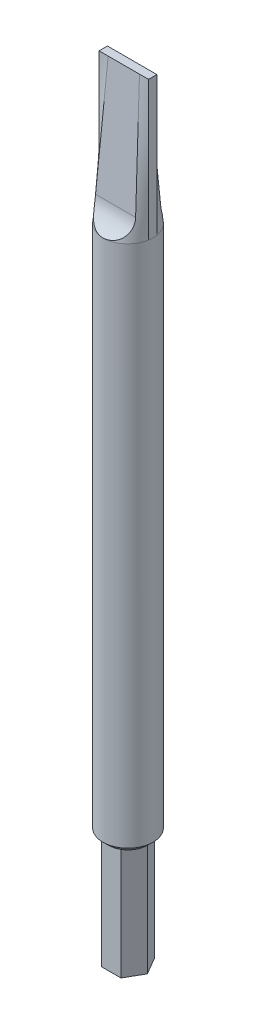
ISO-10303-21;
HEADER;
FILE_DESCRIPTION(('STEP AP214'),'2;1');
FILE_NAME('part.step','',(''),(''),'','','');
FILE_SCHEMA(('AUTOMOTIVE_DESIGN { 1 0 10303 214 1 1 1 1 }'));
ENDSEC;
DATA;
#1=APPLICATION_CONTEXT('core data for automotive mechanical design processes');
#2=APPLICATION_PROTOCOL_DEFINITION('international standard','automotive_design',2000,#1);
#3=PRODUCT_CONTEXT('',#1,'mechanical');
#4=PRODUCT('Part','Part','',(#3));
#5=PRODUCT_RELATED_PRODUCT_CATEGORY('part','',(#4));
#6=PRODUCT_DEFINITION_FORMATION('','',#4);
#7=PRODUCT_DEFINITION_CONTEXT('part definition',#1,'design');
#8=PRODUCT_DEFINITION('design','',#6,#7);
#9=PRODUCT_DEFINITION_SHAPE('','',#8);
#10=(LENGTH_UNIT() NAMED_UNIT(*) SI_UNIT(.MILLI.,.METRE.));
#11=(NAMED_UNIT(*) PLANE_ANGLE_UNIT() SI_UNIT($,.RADIAN.));
#12=(NAMED_UNIT(*) SI_UNIT($,.STERADIAN.) SOLID_ANGLE_UNIT());
#13=UNCERTAINTY_MEASURE_WITH_UNIT(LENGTH_MEASURE(1.E-05),#10,'distance_accuracy_value','');
#14=(GEOMETRIC_REPRESENTATION_CONTEXT(3) GLOBAL_UNCERTAINTY_ASSIGNED_CONTEXT((#13)) GLOBAL_UNIT_ASSIGNED_CONTEXT((#10,
#11,#12)) REPRESENTATION_CONTEXT('',''));
#15=CARTESIAN_POINT('',(0.,0.,0.));
#16=DIRECTION('',(0.,0.,1.));
#17=DIRECTION('',(1.,0.,0.));
#18=AXIS2_PLACEMENT_3D('',#15,#16,#17);
#19=CARTESIAN_POINT('',(4.43705983732471,95.,-0.750000000000001));
#20=CARTESIAN_POINT('',(4.43705983732471,120.,-0.75));
#21=CARTESIAN_POINT('',(4.37543400625076,95.,-1.11458333333333));
#22=CARTESIAN_POINT('',(4.06730485088098,120.,-0.75));
#23=CARTESIAN_POINT('',(4.26263040885428,95.,-1.51144062639458));
#24=CARTESIAN_POINT('',(3.69754986443725,120.,-0.75));
#25=CARTESIAN_POINT('',(3.87668954751207,95.,-2.32932370481561));
#26=CARTESIAN_POINT('',(2.9580398915498,120.,-0.75));
#27=CARTESIAN_POINT('',(3.60180063929756,95.,-2.75068870523416));
#28=CARTESIAN_POINT('',(2.58828490510607,120.,-0.75));
#29=CARTESIAN_POINT('',(2.85210457862929,95.,-3.52203856749311));
#30=CARTESIAN_POINT('',(1.84877493221862,120.,-0.75));
#31=CARTESIAN_POINT('',(2.37524833719888,95.,-3.86993206223975));
#32=CARTESIAN_POINT('',(1.47901994577489,120.,-0.75));
#33=CARTESIAN_POINT('',(1.54287419283115,95.,-4.23811089195704));
#34=CARTESIAN_POINT('',(0.9243874661093,120.,-0.75));
#35=CARTESIAN_POINT('',(1.24681967389097,95.,-4.33516804818502));
#36=CARTESIAN_POINT('',(0.739509972887437,120.,-0.75));
#37=CARTESIAN_POINT('',(0.633788469081093,95.,-4.46615645512624));
#38=CARTESIAN_POINT('',(0.369754986443711,120.,-0.75));
#39=CARTESIAN_POINT('',(0.316932845523195,95.,-4.5));
#40=CARTESIAN_POINT('',(0.184877493221848,120.,-0.75));
#41=CARTESIAN_POINT('',(-0.316932845523193,95.,-4.5));
#42=CARTESIAN_POINT('',(-0.184877493221878,120.,-0.75));
#43=CARTESIAN_POINT('',(-0.633788469081092,95.,-4.46615645512624));
#44=CARTESIAN_POINT('',(-0.369754986443741,120.,-0.75));
#45=CARTESIAN_POINT('',(-1.24681967389097,95.,-4.33516804818502));
#46=CARTESIAN_POINT('',(-0.739509972887467,120.,-0.75));
#47=CARTESIAN_POINT('',(-1.54287419283115,95.,-4.23811089195704));
#48=CARTESIAN_POINT('',(-0.92438746610933,120.,-0.75));
#49=CARTESIAN_POINT('',(-2.37524833719888,95.,-3.86993206223976));
#50=CARTESIAN_POINT('',(-1.47901994577492,120.,-0.75));
#51=CARTESIAN_POINT('',(-2.85210457862929,95.,-3.52203856749311));
#52=CARTESIAN_POINT('',(-1.84877493221864,120.,-0.75));
#53=CARTESIAN_POINT('',(-3.60180063929756,95.,-2.75068870523416));
#54=CARTESIAN_POINT('',(-2.58828490510609,120.,-0.75));
#55=CARTESIAN_POINT('',(-3.87668954751207,95.,-2.32932370481561));
#56=CARTESIAN_POINT('',(-2.95803989154982,120.,-0.75));
#57=CARTESIAN_POINT('',(-4.26263040885428,95.,-1.51144062639458));
#58=CARTESIAN_POINT('',(-3.69754986443726,120.,-0.75));
#59=CARTESIAN_POINT('',(-4.37543400625076,95.,-1.11458333333333));
#60=CARTESIAN_POINT('',(-4.06730485088099,120.,-0.75));
#61=CARTESIAN_POINT('',(-4.43705983732471,95.,-0.750000000000003));
#62=CARTESIAN_POINT('',(-4.43705983732471,120.,-0.75));
#63=B_SPLINE_SURFACE_WITH_KNOTS('',3,1,((#19,#20),(#21,#22),(#23,#24),(#25,#26),(#27,#28),(#29,
#30),(#31,#32),(#33,#34),(#35,#36),(#37,#38),(#39,#40),(#41,#42),(#43,#44),(#45,#46),(#47,#48),
(#49,#50),(#51,#52),(#53,#54),(#55,#56),(#57,#58),(#59,#60),(#61,#62)),.UNSPECIFIED.,.F.,.F.,
.F.,(4,2,2,2,2,2,2,2,2,2,4),(2,2),(0.,0.125,0.25,0.375,0.4375,0.5,0.5625,0.625,0.75,0.875,1.),
(0.,1.),.UNSPECIFIED.);
#64=DIRECTION('',(-1.,0.,0.));
#65=VECTOR('',#64,1.);
#66=CARTESIAN_POINT('',(-4.43705983732471,120.,-0.75));
#67=LINE('',#66,#65);
#68=CARTESIAN_POINT('',(-2.80829555421604,120.,-0.75));
#69=VERTEX_POINT('',#68);
#70=CARTESIAN_POINT('',(-4.43705983732471,120.,-0.75));
#71=VERTEX_POINT('',#70);
#72=EDGE_CURVE('E349',#69,#71,#67,.T.);
#73=CARTESIAN_POINT('',(-3.59892322467151,98.8486745427176,-2.22904475760722));
#74=CARTESIAN_POINT('',(-3.49083341758224,101.740355129243,-2.02683875303279));
#75=CARTESIAN_POINT('',(-3.38274361066169,104.632035715774,-1.82463274845763));
#76=CARTESIAN_POINT('',(-3.11958199560018,111.672286366834,-1.33233046514558));
#77=CARTESIAN_POINT('',(-2.96451018748197,115.820856431362,-1.0422341864086));
#78=CARTESIAN_POINT('',(-2.80905743738754,119.979617663917,-0.751425271782207));
#79=CARTESIAN_POINT('',(-2.80867649580179,119.989808831959,-0.750712635891102));
#80=CARTESIAN_POINT('',(-2.80829555421603,120.,-0.749999999999998));
#81=B_SPLINE_CURVE_WITH_KNOTS('',3,(#73,#74,#75,#76,#77,#78,#79,#80),.UNSPECIFIED.,.F.,.F.,(4,2,
2,4),(0.,8.70226899162103,21.187040926751,21.2177103879796),.UNSPECIFIED.);
#82=CARTESIAN_POINT('',(-3.59892322467151,98.8486745427176,-2.22904475760722));
#83=VERTEX_POINT('',#82);
#84=EDGE_CURVE('E12',#69,#83,#81,.F.);
#85=CARTESIAN_POINT('',(-3.59892322467151,98.8486745427176,-2.22904475760722));
#86=CARTESIAN_POINT('',(-3.60293934350547,98.7405535675186,-2.23658640081067));
#87=CARTESIAN_POINT('',(-3.60406231887814,98.6325831890698,-2.24768729077878));
#88=CARTESIAN_POINT('',(-3.60062632458166,98.4176827890551,-2.2768589978853));
#89=CARTESIAN_POINT('',(-3.59606759944172,98.3107527229157,-2.29492951504155));
#90=CARTESIAN_POINT('',(-3.58135789830064,98.0984465368183,-2.33793636851637));
#91=CARTESIAN_POINT('',(-3.57119554309247,97.9930740283356,-2.36288662370164));
#92=CARTESIAN_POINT('',(-3.54519646245648,97.7848163720109,-2.4193570626618));
#93=CARTESIAN_POINT('',(-3.52935968267629,97.6819312480043,-2.450877309366));
#94=CARTESIAN_POINT('',(-3.49180300241229,97.4792915669902,-2.52012358463183));
#95=CARTESIAN_POINT('',(-3.47007920891334,97.3795391304768,-2.55785371321155));
#96=CARTESIAN_POINT('',(-3.42044540209063,97.1839561915233,-2.63898114056189));
#97=CARTESIAN_POINT('',(-3.39253576053734,97.0881254537983,-2.68237809869079));
#98=CARTESIAN_POINT('',(-3.33016429650252,96.9011908711795,-2.77411901044245));
#99=CARTESIAN_POINT('',(-3.29570870184274,96.8100826373213,-2.82245824195835));
#100=CARTESIAN_POINT('',(-3.21983077575398,96.6332052257892,-2.92326853253749));
#101=CARTESIAN_POINT('',(-3.17840890349768,96.5474356967321,-2.97573931915378));
#102=CARTESIAN_POINT('',(-3.08931934789289,96.3841642770508,-3.08229916826232));
#103=CARTESIAN_POINT('',(-3.04184820942839,96.3065026747279,-3.13630748490522));
#104=CARTESIAN_POINT('',(-2.93961937922463,96.1574699970874,-3.24609114836995));
#105=CARTESIAN_POINT('',(-2.88486173610647,96.0860988798,-3.30186648339899));
#106=CARTESIAN_POINT('',(-2.76802495761936,95.9501240798014,-3.41389420915612));
#107=CARTESIAN_POINT('',(-2.70594985857307,95.8855167029905,-3.47014632114661));
#108=CARTESIAN_POINT('',(-2.57454566103661,95.7633312802212,-3.58180913437112));
#109=CARTESIAN_POINT('',(-2.50521703419322,95.7057527777505,-3.63721989004478));
#110=CARTESIAN_POINT('',(-2.36662240784246,95.6030042398465,-3.74055976544491));
#111=CARTESIAN_POINT('',(-2.29799849056612,95.557172729832,-3.78869425488719));
#112=CARTESIAN_POINT('',(-2.15537476586022,95.471379184874,-3.88214346444769));
#113=CARTESIAN_POINT('',(-2.08137537790893,95.4314166926718,-3.92745840408));
#114=CARTESIAN_POINT('',(-1.92841152270123,95.357303112015,-4.01429097934524));
#115=CARTESIAN_POINT('',(-1.84944733273736,95.323151699396,-4.0558088267348));
#116=CARTESIAN_POINT('',(-1.68712402480413,95.2604593766965,-4.13424043274664));
#117=CARTESIAN_POINT('',(-1.60376463169689,95.2319188183831,-4.17115390264882));
#118=CARTESIAN_POINT('',(-1.43712273157251,95.1812847813427,-4.23826656210703));
#119=CARTESIAN_POINT('',(-1.3539999989422,95.1589619284157,-4.26869055781762));
#120=CARTESIAN_POINT('',(-1.18495484263154,95.1189272696643,-4.32432792432823));
#121=CARTESIAN_POINT('',(-1.09903266347683,95.1012150623184,-4.34954174882048));
#122=CARTESIAN_POINT('',(-0.924932598078182,95.070220925598,-4.39433657508877));
#123=CARTESIAN_POINT('',(-0.83675427189721,95.0569398674735,-4.41391646902067));
#124=CARTESIAN_POINT('',(-0.658769285669557,95.0345977989366,-4.44720694087929));
#125=CARTESIAN_POINT('',(-0.56896253145881,95.0255370333769,-4.46091717825693));
#126=CARTESIAN_POINT('',(-0.385509620516646,95.0112402606007,-4.48268042303993));
#127=CARTESIAN_POINT('',(-0.291830977963934,95.006132111535,-4.49054401554672));
#128=CARTESIAN_POINT('',(-0.104018965992552,95.0001626926024,-4.49974306971542));
#129=CARTESIAN_POINT('',(-0.00988560396492934,94.9993013539384,-4.50107863712935));
#130=CARTESIAN_POINT('',(0.178202704669686,95.0018374616447,-4.49716233857819));
#131=CARTESIAN_POINT('',(0.272157616055407,95.005235675759,-4.49190928507649));
#132=CARTESIAN_POINT('',(0.459234027866628,95.0162932431291,-4.47497289692342));
#133=CARTESIAN_POINT('',(0.552355505127167,95.0239527144534,-4.46328938410067));
#134=CARTESIAN_POINT('',(0.738860208092008,95.0438585489124,-4.43335086394105));
#135=CARTESIAN_POINT('',(0.832215497622931,95.056188364351,-4.4149765476268));
#136=CARTESIAN_POINT('',(1.01667354680881,95.0856772756296,-4.37187860727414));
#137=CARTESIAN_POINT('',(1.10777628358515,95.1028364204979,-4.34715491877576));
#138=CARTESIAN_POINT('',(1.28702287178397,95.1421751673892,-4.29182803289247));
#139=CARTESIAN_POINT('',(1.37516791250423,95.16435272303,-4.2612272328137));
#140=CARTESIAN_POINT('',(1.54787494178746,95.2139877446648,-4.19466440902625));
#141=CARTESIAN_POINT('',(1.63243707322781,95.2414449998754,-4.15870259935999));
#142=CARTESIAN_POINT('',(1.79544952662088,95.3012691059148,-4.082858099758));
#143=CARTESIAN_POINT('',(1.87399420702169,95.3335125112558,-4.04308100568776));
#144=CARTESIAN_POINT('',(2.0264035496312,95.4035706246093,-3.95965926032924));
#145=CARTESIAN_POINT('',(2.10026832935262,95.4413851926499,-3.91601470621929));
#146=CARTESIAN_POINT('',(2.24288717637036,95.5226404168432,-3.82578731131685));
#147=CARTESIAN_POINT('',(2.31164298650577,95.5660791404131,-3.7792054826437));
#148=CARTESIAN_POINT('',(2.44377080230154,95.6586287588433,-3.68400468271338));
#149=CARTESIAN_POINT('',(2.50714041796408,95.7077421491339,-3.63538482126733));
#150=CARTESIAN_POINT('',(2.62666032186387,95.8101915496243,-3.53837633497427));
#151=CARTESIAN_POINT('',(2.68295577770646,95.8633840469406,-3.49001474284895));
#152=CARTESIAN_POINT('',(2.79006884725087,95.9748809658664,-3.39319500258708));
#153=CARTESIAN_POINT('',(2.84088876018525,96.0331832230422,-3.3447369037491));
#154=CARTESIAN_POINT('',(2.93707502413029,96.1546937141666,-3.24854076104307));
#155=CARTESIAN_POINT('',(2.98244042576204,96.217902799026,-3.2008028437863));
#156=CARTESIAN_POINT('',(3.06777803030964,96.3489164800583,-3.10683869375862));
#157=CARTESIAN_POINT('',(3.10775003951796,96.4167212411569,-3.06061251532803));
#158=CARTESIAN_POINT('',(3.18416407341545,96.5597321059367,-2.96833908975292));
#159=CARTESIAN_POINT('',(3.22036341355846,96.6351344801134,-2.92239526675362));
#160=CARTESIAN_POINT('',(3.2873849136145,96.7900695266571,-2.83366315411916));
#161=CARTESIAN_POINT('',(3.31820681246761,96.8696023993054,-2.79087501774205));
#162=CARTESIAN_POINT('',(3.37476790947361,97.0324056636515,-2.70899817110432));
#163=CARTESIAN_POINT('',(3.40050186176428,97.1156798053253,-2.66991330044145));
#164=CARTESIAN_POINT('',(3.44712389972868,97.2854043505638,-2.59597484529307));
#165=CARTESIAN_POINT('',(3.46801162993889,97.3718549865816,-2.5611215712785));
#166=CARTESIAN_POINT('',(3.5069757915443,97.5559809688231,-2.49287212415977));
#167=CARTESIAN_POINT('',(3.52458188224587,97.6539307973772,-2.45994655617388));
#168=CARTESIAN_POINT('',(3.55446054445136,97.8524512880529,-2.40004937285099));
#169=CARTESIAN_POINT('',(3.56673192729788,97.953022528981,-2.3730790851028));
#170=CARTESIAN_POINT('',(3.58603238438208,98.1559350449993,-2.32543629418866));
#171=CARTESIAN_POINT('',(3.59307124359417,98.2582726482058,-2.30475207894015));
#172=CARTESIAN_POINT('',(3.60193736742747,98.4642195504566,-2.26981945950405));
#173=CARTESIAN_POINT('',(3.60376779210896,98.5678280400858,-2.25556715736642));
#174=CARTESIAN_POINT('',(3.60269648866538,98.7011915884293,-2.24146547453206));
#175=CARTESIAN_POINT('',(3.60224547832575,98.7306792901405,-2.23861262204517));
#176=CARTESIAN_POINT('',(3.60091018366326,98.7896652379683,-2.23343437778123));
#177=CARTESIAN_POINT('',(3.60002627752147,98.8191634524649,-2.23110852819975));
#178=CARTESIAN_POINT('',(3.59892322467151,98.8486745427176,-2.22904475760721));
#179=B_SPLINE_CURVE_WITH_KNOTS('',3,(#85,#86,#87,#88,#89,#90,#91,#92,#93,#94,#95,#96,#97,#98,
#99,#100,#101,#102,#103,#104,#105,#106,#107,#108,#109,#110,#111,#112,#113,#114,#115,#116,#117,
#118,#119,#120,#121,#122,#123,#124,#125,#126,#127,#128,#129,#130,#131,#132,#133,#134,#135,#136,
#137,#138,#139,#140,#141,#142,#143,#144,#145,#146,#147,#148,#149,#150,#151,#152,#153,#154,#155,
#156,#157,#158,#159,#160,#161,#162,#163,#164,#165,#166,#167,#168,#169,#170,#171,#172,#173,#174,
#175,#176,#177,#178),.UNSPECIFIED.,.F.,.F.,(4,2,2,2,2,2,2,2,2,2,2,2,2,2,2,2,2,2,2,2,2,2,2,2,2,2,
2,2,2,2,2,2,2,2,2,2,2,2,2,2,2,2,2,2,2,2,4),(0.,0.325263713504758,0.650513428782893,
0.976426069166057,1.30234183138053,1.62847364613805,1.95458586563369,2.28038936168774,
2.60617139126008,2.92324531647702,3.24031712604121,3.5572148494616,3.8740919800042,
4.16033056049353,4.44654682811889,4.73274712426,5.01896535774081,5.29252024995637,
5.56605131146291,5.8396361228373,6.11323680506135,6.3953554772633,6.67746957921292,
6.9596345368696,7.24180731298089,7.52928007371895,7.81675575304794,8.10411441756552,
8.39146161213883,8.67238657308774,8.95330447718824,9.23412610667737,9.51507170066212,
9.78869099227865,10.0621949370541,10.3357464175521,10.6093077202319,10.8952900258812,
11.1812862113206,11.4675757491397,11.7538862792569,12.0680152971346,12.3822142721033,
12.6958241973185,13.0092438085748,13.0981250831556,13.1869288485112),.UNSPECIFIED.);
#180=CARTESIAN_POINT('',(-2.08166817117217E-13,95.,-4.5));
#181=VERTEX_POINT('',#180);
#182=EDGE_CURVE('E87',#83,#181,#179,.T.);
#183=CARTESIAN_POINT('',(0.,95.,0.));
#184=DIRECTION('',(0.,1.,0.));
#185=DIRECTION('',(0.,0.,1.));
#186=AXIS2_PLACEMENT_3D('',#183,#184,#185);
#187=CIRCLE('',#186,4.5);
#188=CARTESIAN_POINT('',(-4.43707106497073,95.,-0.750001902400373));
#189=VERTEX_POINT('',#188);
#190=EDGE_CURVE('E450',#181,#189,#187,.T.);
#191=DIRECTION('',(0.,1.,0.));
#192=VECTOR('',#191,1.);
#193=CARTESIAN_POINT('',(-4.43705983732471,107.5,-0.750000000000001));
#194=LINE('',#193,#192);
#195=EDGE_CURVE('E354',#189,#71,#194,.T.);
#196=ORIENTED_EDGE('',*,*,#72,.F.);
#197=ORIENTED_EDGE('',*,*,#84,.T.);
#198=ORIENTED_EDGE('',*,*,#182,.T.);
#199=ORIENTED_EDGE('',*,*,#190,.T.);
#200=ORIENTED_EDGE('',*,*,#195,.T.);
#201=EDGE_LOOP('',(#196,#197,#198,#199,#200));
#202=FACE_BOUND('',#201,.T.);
#203=ADVANCED_FACE('F75',(#202),#63,.T.);
#204=CARTESIAN_POINT('',(3.59892322467151,98.8486745427176,-2.22904475760722));
#205=VERTEX_POINT('',#204);
#206=EDGE_CURVE('E211',#181,#205,#179,.T.);
#207=CARTESIAN_POINT('',(3.59892322467151,98.8486745427176,-2.22904475760722));
#208=CARTESIAN_POINT('',(3.49083341770127,101.740355129247,-2.02683875303218));
#209=CARTESIAN_POINT('',(3.38274361073189,104.632035715777,-1.82463274845727));
#210=CARTESIAN_POINT('',(3.11958199549942,111.67228636683,-1.33233046514611));
#211=CARTESIAN_POINT('',(2.96451018723644,115.820856431353,-1.04223418640987));
#212=CARTESIAN_POINT('',(2.80905743738631,119.979617663917,-0.751425271782218));
#213=CARTESIAN_POINT('',(2.80867649580116,119.989808831959,-0.750712635891112));
#214=CARTESIAN_POINT('',(2.80829555421601,120.,-0.750000000000006));
#215=B_SPLINE_CURVE_WITH_KNOTS('',3,(#207,#208,#209,#210,#211,#212,#213,#214),.UNSPECIFIED.,.F.,
.F.,(4,2,2,4),(0.,8.70226899162103,21.1870409267509,21.2177103879795),.UNSPECIFIED.);
#216=CARTESIAN_POINT('',(2.80829555421601,120.,-0.749999999999998));
#217=VERTEX_POINT('',#216);
#218=EDGE_CURVE('E216',#205,#217,#215,.T.);
#219=CARTESIAN_POINT('',(4.43705983732471,120.,-0.75));
#220=VERTEX_POINT('',#219);
#221=EDGE_CURVE('E80',#220,#217,#67,.T.);
#222=DIRECTION('',(0.,-1.,0.));
#223=VECTOR('',#222,1.);
#224=CARTESIAN_POINT('',(4.43705983732471,107.5,-0.75));
#225=LINE('',#224,#223);
#226=CARTESIAN_POINT('',(4.43706158842565,95.,-0.750000296483887));
#227=VERTEX_POINT('',#226);
#228=EDGE_CURVE('E331',#220,#227,#225,.T.);
#229=EDGE_CURVE('E378',#227,#181,#187,.T.);
#230=ORIENTED_EDGE('',*,*,#206,.T.);
#231=ORIENTED_EDGE('',*,*,#218,.T.);
#232=ORIENTED_EDGE('',*,*,#221,.F.);
#233=ORIENTED_EDGE('',*,*,#228,.T.);
#234=ORIENTED_EDGE('',*,*,#229,.T.);
#235=EDGE_LOOP('',(#230,#231,#232,#233,#234));
#236=FACE_BOUND('',#235,.T.);
#237=ADVANCED_FACE('F281',(#236),#63,.T.);
#238=CARTESIAN_POINT('',(-4.43705983732471,95.,0.749999999999997));
#239=CARTESIAN_POINT('',(-4.43705983732471,120.,0.75));
#240=CARTESIAN_POINT('',(-4.37543400625076,95.,1.11458333333333));
#241=CARTESIAN_POINT('',(-4.06730485088098,120.,0.75));
#242=CARTESIAN_POINT('',(-4.26263040885428,95.,1.51144062639458));
#243=CARTESIAN_POINT('',(-3.69754986443726,120.,0.75));
#244=CARTESIAN_POINT('',(-3.87668954751207,95.,2.32932370481561));
#245=CARTESIAN_POINT('',(-2.9580398915498,120.,0.75));
#246=CARTESIAN_POINT('',(-3.60180063929756,95.,2.75068870523416));
#247=CARTESIAN_POINT('',(-2.58828490510607,120.,0.75));
#248=CARTESIAN_POINT('',(-2.85210457862929,95.,3.52203856749311));
#249=CARTESIAN_POINT('',(-1.84877493221862,120.,0.75));
#250=CARTESIAN_POINT('',(-2.37524833719888,95.,3.86993206223975));
#251=CARTESIAN_POINT('',(-1.47901994577489,120.,0.75));
#252=CARTESIAN_POINT('',(-1.54287419283115,95.,4.23811089195704));
#253=CARTESIAN_POINT('',(-0.9243874661093,120.,0.75));
#254=CARTESIAN_POINT('',(-1.24681967389097,95.,4.33516804818502));
#255=CARTESIAN_POINT('',(-0.739509972887437,120.,0.75));
#256=CARTESIAN_POINT('',(-0.633788469081094,95.,4.46615645512623));
#257=CARTESIAN_POINT('',(-0.369754986443711,120.,0.75));
#258=CARTESIAN_POINT('',(-0.316932845523195,95.,4.5));
#259=CARTESIAN_POINT('',(-0.184877493221848,120.,0.75));
#260=CARTESIAN_POINT('',(0.316932845523193,95.,4.5));
#261=CARTESIAN_POINT('',(0.184877493221878,120.,0.75));
#262=CARTESIAN_POINT('',(0.633788469081092,95.,4.46615645512624));
#263=CARTESIAN_POINT('',(0.369754986443742,120.,0.75));
#264=CARTESIAN_POINT('',(1.24681967389097,95.,4.33516804818502));
#265=CARTESIAN_POINT('',(0.739509972887468,120.,0.75));
#266=CARTESIAN_POINT('',(1.54287419283115,95.,4.23811089195704));
#267=CARTESIAN_POINT('',(0.92438746610933,120.,0.75));
#268=CARTESIAN_POINT('',(2.37524833719888,95.,3.86993206223975));
#269=CARTESIAN_POINT('',(1.47901994577492,120.,0.75));
#270=CARTESIAN_POINT('',(2.85210457862929,95.,3.52203856749311));
#271=CARTESIAN_POINT('',(1.84877493221864,120.,0.75));
#272=CARTESIAN_POINT('',(3.60180063929756,95.,2.75068870523416));
#273=CARTESIAN_POINT('',(2.58828490510609,120.,0.75));
#274=CARTESIAN_POINT('',(3.87668954751207,95.,2.32932370481561));
#275=CARTESIAN_POINT('',(2.95803989154982,120.,0.75));
#276=CARTESIAN_POINT('',(4.26263040885428,95.,1.51144062639458));
#277=CARTESIAN_POINT('',(3.69754986443726,120.,0.75));
#278=CARTESIAN_POINT('',(4.37543400625076,95.,1.11458333333333));
#279=CARTESIAN_POINT('',(4.06730485088099,120.,0.75));
#280=CARTESIAN_POINT('',(4.43705983732471,95.,0.749999999999996));
#281=CARTESIAN_POINT('',(4.43705983732471,120.,0.75));
#282=B_SPLINE_SURFACE_WITH_KNOTS('',3,1,((#238,#239),(#240,#241),(#242,#243),(#244,#245),(#246,
#247),(#248,#249),(#250,#251),(#252,#253),(#254,#255),(#256,#257),(#258,#259),(#260,#261),(#262,
#263),(#264,#265),(#266,#267),(#268,#269),(#270,#271),(#272,#273),(#274,#275),(#276,#277),(#278,
#279),(#280,#281)),.UNSPECIFIED.,.F.,.F.,.F.,(4,2,2,2,2,2,2,2,2,2,4),(2,2),(0.,0.125,0.25,0.375,
0.4375,0.5,0.5625,0.625,0.75,0.875,1.),(0.,1.),.UNSPECIFIED.);
#283=CARTESIAN_POINT('',(3.59892322467151,98.8486745427176,2.22904475760722));
#284=CARTESIAN_POINT('',(3.49083341758818,101.740355129243,2.02683875303269));
#285=CARTESIAN_POINT('',(3.38274361066519,104.632035715774,1.82463274845758));
#286=CARTESIAN_POINT('',(3.11958199559514,111.672286366833,1.33233046514569));
#287=CARTESIAN_POINT('',(2.9645101874697,115.820856431362,1.04223418640882));
#288=CARTESIAN_POINT('',(2.80905743738747,119.979617663917,0.751425271782208));
#289=CARTESIAN_POINT('',(2.80867649580175,119.989808831959,0.750712635891103));
#290=CARTESIAN_POINT('',(2.80829555421603,120.,0.749999999999999));
#291=B_SPLINE_CURVE_WITH_KNOTS('',3,(#283,#284,#285,#286,#287,#288,#289,#290),.UNSPECIFIED.,.F.,
.F.,(4,2,2,4),(0.,8.70226899162083,21.187040926751,21.2177103879796),.UNSPECIFIED.);
#292=CARTESIAN_POINT('',(3.59892322467151,98.8486745427176,2.22904475760722));
#293=VERTEX_POINT('',#292);
#294=CARTESIAN_POINT('',(2.80829555421602,120.,0.749999999999998));
#295=VERTEX_POINT('',#294);
#296=EDGE_CURVE('E198',#293,#295,#291,.T.);
#297=CARTESIAN_POINT('',(-3.59892322467151,98.8486745427176,2.22904475760722));
#298=CARTESIAN_POINT('',(-3.60293934350547,98.7405535675186,2.23658640081067));
#299=CARTESIAN_POINT('',(-3.60406231887813,98.6325831890699,2.24768729077878));
#300=CARTESIAN_POINT('',(-3.60062632458165,98.4176827890551,2.2768589978853));
#301=CARTESIAN_POINT('',(-3.59606759944171,98.3107527229158,2.29492951504155));
#302=CARTESIAN_POINT('',(-3.58135789830064,98.0984465368184,2.33793636851636));
#303=CARTESIAN_POINT('',(-3.57119554309247,97.9930740283356,2.36288662370164));
#304=CARTESIAN_POINT('',(-3.54519646245648,97.7848163720109,2.41935706266179));
#305=CARTESIAN_POINT('',(-3.5293596826763,97.6819312480044,2.45087730936599));
#306=CARTESIAN_POINT('',(-3.4918030024123,97.4792915669902,2.52012358463182));
#307=CARTESIAN_POINT('',(-3.47007920891335,97.3795391304769,2.55785371321153));
#308=CARTESIAN_POINT('',(-3.42044540209064,97.1839561915233,2.63898114056187));
#309=CARTESIAN_POINT('',(-3.39253576053734,97.0881254537983,2.68237809869077));
#310=CARTESIAN_POINT('',(-3.33016429650252,96.9011908711795,2.77411901044243));
#311=CARTESIAN_POINT('',(-3.29570870184274,96.8100826373213,2.82245824195834));
#312=CARTESIAN_POINT('',(-3.21983077575399,96.6332052257892,2.92326853253748));
#313=CARTESIAN_POINT('',(-3.1784089034977,96.5474356967321,2.97573931915376));
#314=CARTESIAN_POINT('',(-3.08931934789291,96.3841642770508,3.0822991682623));
#315=CARTESIAN_POINT('',(-3.0418482094284,96.306502674728,3.13630748490521));
#316=CARTESIAN_POINT('',(-2.93961937922464,96.1574699970874,3.24609114836993));
#317=CARTESIAN_POINT('',(-2.88486173610649,96.0860988798,3.30186648339896));
#318=CARTESIAN_POINT('',(-2.76802495761938,95.9501240798014,3.4138942091561));
#319=CARTESIAN_POINT('',(-2.70594985857309,95.8855167029905,3.47014632114659));
#320=CARTESIAN_POINT('',(-2.57454566103664,95.7633312802212,3.5818091343711));
#321=CARTESIAN_POINT('',(-2.50521703419326,95.7057527777506,3.63721989004475));
#322=CARTESIAN_POINT('',(-2.36662240784251,95.6030042398465,3.74055976544488));
#323=CARTESIAN_POINT('',(-2.29799849056616,95.5571727298321,3.78869425488717));
#324=CARTESIAN_POINT('',(-2.15537476586026,95.4713791848741,3.88214346444766));
#325=CARTESIAN_POINT('',(-2.08137537790897,95.4314166926718,3.92745840407998));
#326=CARTESIAN_POINT('',(-1.92841152270126,95.357303112015,4.01429097934522));
#327=CARTESIAN_POINT('',(-1.84944733273739,95.3231516993961,4.05580882673478));
#328=CARTESIAN_POINT('',(-1.68712402480416,95.2604593766965,4.13424043274662));
#329=CARTESIAN_POINT('',(-1.60376463169692,95.2319188183831,4.1711539026488));
#330=CARTESIAN_POINT('',(-1.43712273157255,95.1812847813427,4.23826656210701));
#331=CARTESIAN_POINT('',(-1.35399999894224,95.1589619284157,4.2686905578176));
#332=CARTESIAN_POINT('',(-1.18495484263158,95.1189272696643,4.32432792432822));
#333=CARTESIAN_POINT('',(-1.09903266347688,95.1012150623184,4.34954174882046));
#334=CARTESIAN_POINT('',(-0.924932598078233,95.070220925598,4.39433657508876));
#335=CARTESIAN_POINT('',(-0.836754271897261,95.0569398674736,4.41391646902066));
#336=CARTESIAN_POINT('',(-0.658769285669614,95.0345977989366,4.44720694087928));
#337=CARTESIAN_POINT('',(-0.568962531458873,95.0255370333768,4.46091717825692));
#338=CARTESIAN_POINT('',(-0.385509620516714,95.0112402606007,4.48268042303992));
#339=CARTESIAN_POINT('',(-0.291830977964001,95.006132111535,4.49054401554671));
#340=CARTESIAN_POINT('',(-0.104018965992619,95.0001626926024,4.49974306971541));
#341=CARTESIAN_POINT('',(-0.00988560396499561,94.9993013539384,4.50107863712935));
#342=CARTESIAN_POINT('',(0.178202704669619,95.0018374616447,4.49716233857819));
#343=CARTESIAN_POINT('',(0.27215761605534,95.005235675759,4.49190928507649));
#344=CARTESIAN_POINT('',(0.459234027866563,95.0162932431291,4.47497289692343));
#345=CARTESIAN_POINT('',(0.552355505127104,95.0239527144534,4.46328938410068));
#346=CARTESIAN_POINT('',(0.738860208091943,95.0438585489124,4.43335086394106));
#347=CARTESIAN_POINT('',(0.832215497622863,95.056188364351,4.41497654762681));
#348=CARTESIAN_POINT('',(1.01667354680874,95.0856772756296,4.37187860727415));
#349=CARTESIAN_POINT('',(1.10777628358509,95.1028364204979,4.34715491877578));
#350=CARTESIAN_POINT('',(1.2870228717839,95.1421751673892,4.29182803289249));
#351=CARTESIAN_POINT('',(1.37516791250416,95.16435272303,4.26122723281373));
#352=CARTESIAN_POINT('',(1.54787494178739,95.2139877446647,4.19466440902628));
#353=CARTESIAN_POINT('',(1.63243707322774,95.2414449998754,4.15870259936002));
#354=CARTESIAN_POINT('',(1.79544952662082,95.3012691059148,4.08285809975804));
#355=CARTESIAN_POINT('',(1.87399420702163,95.3335125112558,4.04308100568779));
#356=CARTESIAN_POINT('',(2.02640354963115,95.4035706246092,3.95965926032928));
#357=CARTESIAN_POINT('',(2.10026832935257,95.4413851926499,3.91601470621933));
#358=CARTESIAN_POINT('',(2.24288717637031,95.5226404168432,3.82578731131688));
#359=CARTESIAN_POINT('',(2.31164298650572,95.566079140413,3.77920548264374));
#360=CARTESIAN_POINT('',(2.44377080230149,95.6586287588432,3.68400468271341));
#361=CARTESIAN_POINT('',(2.50714041796404,95.7077421491338,3.63538482126736));
#362=CARTESIAN_POINT('',(2.62666032186382,95.8101915496242,3.5383763349743));
#363=CARTESIAN_POINT('',(2.68295577770641,95.8633840469405,3.490014742849));
#364=CARTESIAN_POINT('',(2.79006884725082,95.9748809658664,3.39319500258713));
#365=CARTESIAN_POINT('',(2.84088876018521,96.0331832230422,3.34473690374915));
#366=CARTESIAN_POINT('',(2.93707502413024,96.1546937141666,3.24854076104312));
#367=CARTESIAN_POINT('',(2.98244042576199,96.2179027990259,3.20080284378636));
#368=CARTESIAN_POINT('',(3.06777803030959,96.3489164800582,3.10683869375867));
#369=CARTESIAN_POINT('',(3.10775003951793,96.4167212411568,3.06061251532807));
#370=CARTESIAN_POINT('',(3.18416407341542,96.5597321059367,2.96833908975296));
#371=CARTESIAN_POINT('',(3.22036341355843,96.6351344801133,2.92239526675366));
#372=CARTESIAN_POINT('',(3.28738491361447,96.790069526657,2.83366315411919));
#373=CARTESIAN_POINT('',(3.31820681246759,96.8696023993053,2.79087501774208));
#374=CARTESIAN_POINT('',(3.3747679094736,97.0324056636514,2.70899817110435));
#375=CARTESIAN_POINT('',(3.40050186176426,97.1156798053252,2.66991330044148));
#376=CARTESIAN_POINT('',(3.44712389972866,97.2854043505638,2.59597484529309));
#377=CARTESIAN_POINT('',(3.46801162993887,97.3718549865815,2.56112157127853));
#378=CARTESIAN_POINT('',(3.50697579154429,97.5559809688231,2.49287212415979));
#379=CARTESIAN_POINT('',(3.52458188224587,97.6539307973771,2.4599465561739));
#380=CARTESIAN_POINT('',(3.55446054445136,97.8524512880529,2.40004937285101));
#381=CARTESIAN_POINT('',(3.56673192729788,97.9530225289809,2.37307908510282));
#382=CARTESIAN_POINT('',(3.58603238438208,98.1559350449992,2.32543629418868));
#383=CARTESIAN_POINT('',(3.59307124359416,98.2582726482057,2.30475207894016));
#384=CARTESIAN_POINT('',(3.60193736742747,98.4642195504566,2.26981945950406));
#385=CARTESIAN_POINT('',(3.60376779210897,98.5678280400857,2.25556715736643));
#386=CARTESIAN_POINT('',(3.60269648866538,98.7011915884293,2.24146547453206));
#387=CARTESIAN_POINT('',(3.60224547832575,98.7306792901405,2.23861262204518));
#388=CARTESIAN_POINT('',(3.60091018366326,98.7896652379683,2.23343437778123));
#389=CARTESIAN_POINT('',(3.60002627752147,98.8191634524649,2.23110852819975));
#390=CARTESIAN_POINT('',(3.59892322467151,98.8486745427176,2.22904475760721));
#391=B_SPLINE_CURVE_WITH_KNOTS('',3,(#297,#298,#299,#300,#301,#302,#303,#304,#305,#306,#307,
#308,#309,#310,#311,#312,#313,#314,#315,#316,#317,#318,#319,#320,#321,#322,#323,#324,#325,#326,
#327,#328,#329,#330,#331,#332,#333,#334,#335,#336,#337,#338,#339,#340,#341,#342,#343,#344,#345,
#346,#347,#348,#349,#350,#351,#352,#353,#354,#355,#356,#357,#358,#359,#360,#361,#362,#363,#364,
#365,#366,#367,#368,#369,#370,#371,#372,#373,#374,#375,#376,#377,#378,#379,#380,#381,#382,#383,
#384,#385,#386,#387,#388,#389,#390),.UNSPECIFIED.,.F.,.F.,(4,2,2,2,2,2,2,2,2,2,2,2,2,2,2,2,2,2,
2,2,2,2,2,2,2,2,2,2,2,2,2,2,2,2,2,2,2,2,2,2,2,2,2,2,2,2,4),(0.,0.325263713504744,
0.650513428782865,0.976426069166028,1.3023418313805,1.62847364613801,1.95458586563365,
2.28038936168772,2.60617139126005,2.92324531647698,3.24031712604117,3.55721484946156,
3.87409198000414,4.16033056049347,4.44654682811885,4.73274712425996,5.01896535774076,
5.29252024995631,5.56605131146285,5.83963612283724,6.11323680506128,6.39535547726323,
6.67746957921285,6.95963453686953,7.24180731298082,7.52928007371888,7.81675575304787,
8.10411441756544,8.39146161213875,8.67238657308766,8.95330447718817,9.23412610667729,
9.51507170066204,9.78869099227856,10.062194937054,10.335746417552,10.6093077202319,
10.8952900258811,11.1812862113205,11.4675757491396,11.7538862792568,12.0680152971346,
12.3822142721033,12.6958241973185,13.0092438085747,13.0981250831556,13.1869288485113),.UNSPECIFIED.);
#392=CARTESIAN_POINT('',(0.,95.,4.5));
#393=VERTEX_POINT('',#392);
#394=EDGE_CURVE('E185',#393,#293,#391,.T.);
#395=CARTESIAN_POINT('',(0.,95.,0.));
#396=DIRECTION('',(0.,-1.,0.));
#397=DIRECTION('',(0.,0.,1.));
#398=AXIS2_PLACEMENT_3D('',#395,#396,#397);
#399=CIRCLE('',#398,4.5);
#400=CARTESIAN_POINT('',(4.43707106497042,95.,0.750001902400309));
#401=VERTEX_POINT('',#400);
#402=EDGE_CURVE('E273',#393,#401,#399,.F.);
#403=DIRECTION('',(0.,1.,0.));
#404=VECTOR('',#403,1.);
#405=CARTESIAN_POINT('',(4.43705983732471,107.5,0.749999999999998));
#406=LINE('',#405,#404);
#407=CARTESIAN_POINT('',(4.43705983732471,120.,0.75));
#408=VERTEX_POINT('',#407);
#409=EDGE_CURVE('E474',#401,#408,#406,.T.);
#410=DIRECTION('',(1.,0.,0.));
#411=VECTOR('',#410,1.);
#412=CARTESIAN_POINT('',(-4.43705983732471,120.,0.75));
#413=LINE('',#412,#411);
#414=EDGE_CURVE('E208',#295,#408,#413,.T.);
#415=ORIENTED_EDGE('',*,*,#296,.F.);
#416=ORIENTED_EDGE('',*,*,#394,.F.);
#417=ORIENTED_EDGE('',*,*,#402,.T.);
#418=ORIENTED_EDGE('',*,*,#409,.T.);
#419=ORIENTED_EDGE('',*,*,#414,.F.);
#420=EDGE_LOOP('',(#415,#416,#417,#418,#419));
#421=FACE_BOUND('',#420,.T.);
#422=ADVANCED_FACE('F206',(#421),#282,.T.);
#423=CARTESIAN_POINT('',(0.,0.,0.));
#424=DIRECTION('',(0.,1.,0.));
#425=DIRECTION('',(0.,0.,1.));
#426=AXIS2_PLACEMENT_3D('',#423,#424,#425);
#427=PLANE('',#426);
#428=DIRECTION('',(0.499999999999995,0.,0.866025403784441));
#429=VECTOR('',#428,1.);
#430=CARTESIAN_POINT('',(1.73205080756892,0.,-2.99999999999999));
#431=LINE('',#430,#429);
#432=CARTESIAN_POINT('',(1.73205229513202,0.,-3.00000257797087));
#433=VERTEX_POINT('',#432);
#434=CARTESIAN_POINT('',(3.46410161513776,0.,0.));
#435=VERTEX_POINT('',#434);
#436=EDGE_CURVE('E578',#433,#435,#431,.T.);
#437=ORIENTED_EDGE('',*,*,#436,.F.);
#438=CARTESIAN_POINT('',(0.,0.,0.));
#439=DIRECTION('',(0.,1.,0.));
#440=DIRECTION('',(0.,0.,1.));
#441=AXIS2_PLACEMENT_3D('',#438,#439,#440);
#442=CIRCLE('',#441,3.46410161513776);
#443=EDGE_CURVE('E491',#435,#433,#442,.T.);
#444=ORIENTED_EDGE('',*,*,#443,.F.);
#445=EDGE_LOOP('',(#437,#444));
#446=FACE_BOUND('',#445,.T.);
#447=ADVANCED_FACE('F77',(#446),#427,.F.);
#448=DIRECTION('',(1.,0.,0.));
#449=VECTOR('',#448,1.);
#450=CARTESIAN_POINT('',(-1.73205080756885,0.,-3.00000000000002));
#451=LINE('',#450,#449);
#452=CARTESIAN_POINT('',(-1.73205338696542,0.,-2.9999973194406));
#453=VERTEX_POINT('',#452);
#454=EDGE_CURVE('E558',#453,#433,#451,.T.);
#455=ORIENTED_EDGE('',*,*,#454,.F.);
#456=EDGE_CURVE('E495',#433,#453,#442,.T.);
#457=ORIENTED_EDGE('',*,*,#456,.F.);
#458=EDGE_LOOP('',(#455,#457));
#459=FACE_BOUND('',#458,.T.);
#460=ADVANCED_FACE('F725',(#459),#427,.F.);
#461=DIRECTION('',(0.500000000000007,0.,-0.866025403784434));
#462=VECTOR('',#461,1.);
#463=CARTESIAN_POINT('',(-3.46410161513776,0.,0.));
#464=LINE('',#463,#462);
#465=CARTESIAN_POINT('',(-3.46410161513776,0.,0.));
#466=VERTEX_POINT('',#465);
#467=EDGE_CURVE('E562',#466,#453,#464,.T.);
#468=ORIENTED_EDGE('',*,*,#467,.F.);
#469=EDGE_CURVE('E499',#453,#466,#442,.T.);
#470=ORIENTED_EDGE('',*,*,#469,.F.);
#471=EDGE_LOOP('',(#468,#470));
#472=FACE_BOUND('',#471,.T.);
#473=ADVANCED_FACE('F748',(#472),#427,.F.);
#474=DIRECTION('',(-0.499999999999995,0.,-0.866025403784442));
#475=VECTOR('',#474,1.);
#476=CARTESIAN_POINT('',(-1.7320508075689,0.,3.));
#477=LINE('',#476,#475);
#478=CARTESIAN_POINT('',(-1.732052295132,0.,3.00000257797088));
#479=VERTEX_POINT('',#478);
#480=EDGE_CURVE('E566',#479,#466,#477,.T.);
#481=ORIENTED_EDGE('',*,*,#480,.F.);
#482=EDGE_CURVE('E503',#466,#479,#442,.T.);
#483=ORIENTED_EDGE('',*,*,#482,.F.);
#484=EDGE_LOOP('',(#481,#483));
#485=FACE_BOUND('',#484,.T.);
#486=ADVANCED_FACE('F750',(#485),#427,.F.);
#487=DIRECTION('',(-1.,0.,0.));
#488=VECTOR('',#487,1.);
#489=CARTESIAN_POINT('',(1.73205080756887,0.,3.00000000000001));
#490=LINE('',#489,#488);
#491=CARTESIAN_POINT('',(1.73205080756887,0.,3.00000000000001));
#492=VERTEX_POINT('',#491);
#493=EDGE_CURVE('E570',#492,#479,#490,.T.);
#494=ORIENTED_EDGE('',*,*,#493,.F.);
#495=EDGE_CURVE('E507',#479,#492,#442,.T.);
#496=ORIENTED_EDGE('',*,*,#495,.F.);
#497=EDGE_LOOP('',(#494,#496));
#498=FACE_BOUND('',#497,.T.);
#499=ADVANCED_FACE('F755',(#498),#427,.F.);
#500=DIRECTION('',(-0.500000000000001,0.,0.866025403784438));
#501=VECTOR('',#500,1.);
#502=CARTESIAN_POINT('',(3.46410161513776,0.,0.));
#503=LINE('',#502,#501);
#504=EDGE_CURVE('E574',#435,#492,#503,.T.);
#505=ORIENTED_EDGE('',*,*,#504,.F.);
#506=EDGE_CURVE('E193',#492,#435,#442,.T.);
#507=ORIENTED_EDGE('',*,*,#506,.F.);
#508=EDGE_LOOP('',(#505,#507));
#509=FACE_BOUND('',#508,.T.);
#510=ADVANCED_FACE('F698',(#509),#427,.F.);
#511=CARTESIAN_POINT('',(0.,0.,0.));
#512=DIRECTION('',(0.,1.,0.));
#513=DIRECTION('',(0.,0.,1.));
#514=AXIS2_PLACEMENT_3D('',#511,#512,#513);
#515=CONICAL_SURFACE('',#514,3.46410161513776,0.803029036042637);
#516=CARTESIAN_POINT('',(0.,1.,0.));
#517=DIRECTION('',(0.,1.,0.));
#518=DIRECTION('',(0.,0.,1.));
#519=AXIS2_PLACEMENT_3D('',#516,#517,#518);
#520=CIRCLE('',#519,4.5);
#521=CARTESIAN_POINT('',(0.,1.,4.5));
#522=VERTEX_POINT('',#521);
#523=EDGE_CURVE('E511',#522,#522,#520,.T.);
#524=ORIENTED_EDGE('',*,*,#523,.F.);
#525=EDGE_LOOP('',(#524));
#526=FACE_BOUND('',#525,.T.);
#527=ORIENTED_EDGE('',*,*,#506,.T.);
#528=ORIENTED_EDGE('',*,*,#443,.T.);
#529=ORIENTED_EDGE('',*,*,#456,.T.);
#530=ORIENTED_EDGE('',*,*,#469,.T.);
#531=ORIENTED_EDGE('',*,*,#482,.T.);
#532=ORIENTED_EDGE('',*,*,#495,.T.);
#533=EDGE_LOOP('',(#527,#528,#529,#530,#531,#532));
#534=FACE_BOUND('',#533,.T.);
#535=ADVANCED_FACE('F688',(#526,#534),#515,.T.);
#536=CARTESIAN_POINT('',(1.73205080756892,-20.,-2.99999999999999));
#537=DIRECTION('',(-0.866025403784441,0.,0.499999999999995));
#538=DIRECTION('',(0.499999999999995,0.,0.866025403784441));
#539=AXIS2_PLACEMENT_3D('',#536,#537,#538);
#540=PLANE('',#539);
#541=ORIENTED_EDGE('',*,*,#436,.T.);
#542=DIRECTION('',(0.,1.,0.));
#543=VECTOR('',#542,1.);
#544=CARTESIAN_POINT('',(3.46410161513776,-20.,0.));
#545=LINE('',#544,#543);
#546=CARTESIAN_POINT('',(3.46410161513776,-20.,0.));
#547=VERTEX_POINT('',#546);
#548=EDGE_CURVE('E515',#547,#435,#545,.T.);
#549=ORIENTED_EDGE('',*,*,#548,.F.);
#550=DIRECTION('',(0.499999999999995,0.,0.866025403784441));
#551=VECTOR('',#550,1.);
#552=CARTESIAN_POINT('',(1.73205080756892,-20.,-2.99999999999999));
#553=LINE('',#552,#551);
#554=CARTESIAN_POINT('',(1.73205080756892,-20.,-2.99999999999999));
#555=VERTEX_POINT('',#554);
#556=EDGE_CURVE('E554',#555,#547,#553,.T.);
#557=ORIENTED_EDGE('',*,*,#556,.F.);
#558=DIRECTION('',(0.,1.,0.));
#559=VECTOR('',#558,1.);
#560=CARTESIAN_POINT('',(1.73205080756892,-20.,-2.99999999999999));
#561=LINE('',#560,#559);
#562=EDGE_CURVE('E535',#555,#433,#561,.T.);
#563=ORIENTED_EDGE('',*,*,#562,.T.);
#564=EDGE_LOOP('',(#541,#549,#557,#563));
#565=FACE_BOUND('',#564,.T.);
#566=ADVANCED_FACE('F697',(#565),#540,.F.);
#567=CARTESIAN_POINT('',(3.46410161513776,-20.,0.));
#568=DIRECTION('',(-0.866025403784438,0.,-0.500000000000001));
#569=DIRECTION('',(-0.500000000000001,0.,0.866025403784438));
#570=AXIS2_PLACEMENT_3D('',#567,#568,#569);
#571=PLANE('',#570);
#572=ORIENTED_EDGE('',*,*,#504,.T.);
#573=DIRECTION('',(0.,1.,0.));
#574=VECTOR('',#573,1.);
#575=CARTESIAN_POINT('',(1.73205080756887,-20.,3.00000000000001));
#576=LINE('',#575,#574);
#577=CARTESIAN_POINT('',(1.73205080756887,-20.,3.00000000000001));
#578=VERTEX_POINT('',#577);
#579=EDGE_CURVE('E519',#578,#492,#576,.T.);
#580=ORIENTED_EDGE('',*,*,#579,.F.);
#581=DIRECTION('',(-0.500000000000001,0.,0.866025403784438));
#582=VECTOR('',#581,1.);
#583=CARTESIAN_POINT('',(3.46410161513776,-20.,0.));
#584=LINE('',#583,#582);
#585=EDGE_CURVE('E551',#547,#578,#584,.T.);
#586=ORIENTED_EDGE('',*,*,#585,.F.);
#587=ORIENTED_EDGE('',*,*,#548,.T.);
#588=EDGE_LOOP('',(#572,#580,#586,#587));
#589=FACE_BOUND('',#588,.T.);
#590=ADVANCED_FACE('F716',(#589),#571,.F.);
#591=CARTESIAN_POINT('',(1.73205080756887,-20.,3.00000000000001));
#592=DIRECTION('',(0.,0.,-1.));
#593=DIRECTION('',(-1.,0.,0.));
#594=AXIS2_PLACEMENT_3D('',#591,#592,#593);
#595=PLANE('',#594);
#596=ORIENTED_EDGE('',*,*,#493,.T.);
#597=DIRECTION('',(0.,1.,0.));
#598=VECTOR('',#597,1.);
#599=CARTESIAN_POINT('',(-1.7320508075689,-20.,3.));
#600=LINE('',#599,#598);
#601=CARTESIAN_POINT('',(-1.7320508075689,-20.,3.));
#602=VERTEX_POINT('',#601);
#603=EDGE_CURVE('E523',#602,#479,#600,.T.);
#604=ORIENTED_EDGE('',*,*,#603,.F.);
#605=DIRECTION('',(-1.,0.,0.));
#606=VECTOR('',#605,1.);
#607=CARTESIAN_POINT('',(1.73205080756887,-20.,3.00000000000001));
#608=LINE('',#607,#606);
#609=EDGE_CURVE('E548',#578,#602,#608,.T.);
#610=ORIENTED_EDGE('',*,*,#609,.F.);
#611=ORIENTED_EDGE('',*,*,#579,.T.);
#612=EDGE_LOOP('',(#596,#604,#610,#611));
#613=FACE_BOUND('',#612,.T.);
#614=ADVANCED_FACE('F734',(#613),#595,.F.);
#615=CARTESIAN_POINT('',(-1.7320508075689,-20.,3.));
#616=DIRECTION('',(0.866025403784442,0.,-0.499999999999995));
#617=DIRECTION('',(-0.499999999999995,0.,-0.866025403784442));
#618=AXIS2_PLACEMENT_3D('',#615,#616,#617);
#619=PLANE('',#618);
#620=ORIENTED_EDGE('',*,*,#480,.T.);
#621=DIRECTION('',(0.,1.,0.));
#622=VECTOR('',#621,1.);
#623=CARTESIAN_POINT('',(-3.46410161513776,-20.,0.));
#624=LINE('',#623,#622);
#625=CARTESIAN_POINT('',(-3.46410161513776,-20.,0.));
#626=VERTEX_POINT('',#625);
#627=EDGE_CURVE('E527',#626,#466,#624,.T.);
#628=ORIENTED_EDGE('',*,*,#627,.F.);
#629=DIRECTION('',(-0.499999999999995,0.,-0.866025403784442));
#630=VECTOR('',#629,1.);
#631=CARTESIAN_POINT('',(-1.7320508075689,-20.,3.));
#632=LINE('',#631,#630);
#633=EDGE_CURVE('E545',#602,#626,#632,.T.);
#634=ORIENTED_EDGE('',*,*,#633,.F.);
#635=ORIENTED_EDGE('',*,*,#603,.T.);
#636=EDGE_LOOP('',(#620,#628,#634,#635));
#637=FACE_BOUND('',#636,.T.);
#638=ADVANCED_FACE('F738',(#637),#619,.F.);
#639=CARTESIAN_POINT('',(-3.46410161513776,-20.,0.));
#640=DIRECTION('',(0.866025403784435,0.,0.500000000000007));
#641=DIRECTION('',(0.500000000000007,0.,-0.866025403784435));
#642=AXIS2_PLACEMENT_3D('',#639,#640,#641);
#643=PLANE('',#642);
#644=ORIENTED_EDGE('',*,*,#467,.T.);
#645=DIRECTION('',(0.,1.,0.));
#646=VECTOR('',#645,1.);
#647=CARTESIAN_POINT('',(-1.73205080756885,-20.,-3.00000000000002));
#648=LINE('',#647,#646);
#649=CARTESIAN_POINT('',(-1.73205080756885,-20.,-3.00000000000002));
#650=VERTEX_POINT('',#649);
#651=EDGE_CURVE('E531',#650,#453,#648,.T.);
#652=ORIENTED_EDGE('',*,*,#651,.F.);
#653=DIRECTION('',(0.500000000000007,0.,-0.866025403784434));
#654=VECTOR('',#653,1.);
#655=CARTESIAN_POINT('',(-3.46410161513776,-20.,0.));
#656=LINE('',#655,#654);
#657=EDGE_CURVE('E542',#626,#650,#656,.T.);
#658=ORIENTED_EDGE('',*,*,#657,.F.);
#659=ORIENTED_EDGE('',*,*,#627,.T.);
#660=EDGE_LOOP('',(#644,#652,#658,#659));
#661=FACE_BOUND('',#660,.T.);
#662=ADVANCED_FACE('F747',(#661),#643,.F.);
#663=CARTESIAN_POINT('',(-1.73205080756885,-20.,-3.00000000000002));
#664=DIRECTION('',(0.,0.,1.));
#665=DIRECTION('',(1.,0.,0.));
#666=AXIS2_PLACEMENT_3D('',#663,#664,#665);
#667=PLANE('',#666);
#668=ORIENTED_EDGE('',*,*,#454,.T.);
#669=ORIENTED_EDGE('',*,*,#562,.F.);
#670=DIRECTION('',(1.,0.,0.));
#671=VECTOR('',#670,1.);
#672=CARTESIAN_POINT('',(-1.73205080756885,-20.,-3.00000000000002));
#673=LINE('',#672,#671);
#674=EDGE_CURVE('E539',#650,#555,#673,.T.);
#675=ORIENTED_EDGE('',*,*,#674,.F.);
#676=ORIENTED_EDGE('',*,*,#651,.T.);
#677=EDGE_LOOP('',(#668,#669,#675,#676));
#678=FACE_BOUND('',#677,.T.);
#679=ADVANCED_FACE('F745',(#678),#667,.F.);
#680=CARTESIAN_POINT('',(0.,-20.,0.));
#681=DIRECTION('',(0.,-1.,0.));
#682=DIRECTION('',(0.,0.,-1.));
#683=AXIS2_PLACEMENT_3D('',#680,#681,#682);
#684=PLANE('',#683);
#685=ORIENTED_EDGE('',*,*,#556,.T.);
#686=ORIENTED_EDGE('',*,*,#585,.T.);
#687=ORIENTED_EDGE('',*,*,#609,.T.);
#688=ORIENTED_EDGE('',*,*,#633,.T.);
#689=ORIENTED_EDGE('',*,*,#657,.T.);
#690=ORIENTED_EDGE('',*,*,#674,.T.);
#691=EDGE_LOOP('',(#685,#686,#687,#688,#689,#690));
#692=FACE_BOUND('',#691,.T.);
#693=ADVANCED_FACE('F624',(#692),#684,.T.);
#694=CARTESIAN_POINT('',(0.,95.,0.));
#695=DIRECTION('',(0.,-1.,0.));
#696=DIRECTION('',(0.,0.,-1.));
#697=AXIS2_PLACEMENT_3D('',#694,#695,#696);
#698=CYLINDRICAL_SURFACE('',#697,4.5);
#699=CARTESIAN_POINT('',(0.,95.,0.));
#700=DIRECTION('',(0.,1.,0.));
#701=DIRECTION('',(0.,0.,1.));
#702=AXIS2_PLACEMENT_3D('',#699,#700,#701);
#703=CIRCLE('',#702,4.5);
#704=EDGE_CURVE('E582',#401,#227,#703,.T.);
#705=ORIENTED_EDGE('',*,*,#704,.F.);
#706=ORIENTED_EDGE('',*,*,#402,.F.);
#707=CARTESIAN_POINT('',(-4.43705983732471,95.,0.749999999999997));
#708=VERTEX_POINT('',#707);
#709=EDGE_CURVE('E458',#708,#393,#399,.F.);
#710=ORIENTED_EDGE('',*,*,#709,.F.);
#711=CARTESIAN_POINT('',(0.,95.,0.));
#712=DIRECTION('',(0.,1.,0.));
#713=DIRECTION('',(0.,0.,1.));
#714=AXIS2_PLACEMENT_3D('',#711,#712,#713);
#715=CIRCLE('',#714,4.5);
#716=EDGE_CURVE('E454',#189,#708,#715,.T.);
#717=ORIENTED_EDGE('',*,*,#716,.F.);
#718=ORIENTED_EDGE('',*,*,#190,.F.);
#719=ORIENTED_EDGE('',*,*,#229,.F.);
#720=EDGE_LOOP('',(#705,#706,#710,#717,#718,#719));
#721=FACE_BOUND('',#720,.T.);
#722=ORIENTED_EDGE('',*,*,#523,.T.);
#723=EDGE_LOOP('',(#722));
#724=FACE_BOUND('',#723,.T.);
#725=ADVANCED_FACE('F615',(#721,#724),#698,.T.);
#726=CARTESIAN_POINT('',(0.,120.,0.));
#727=DIRECTION('',(0.,1.,0.));
#728=DIRECTION('',(0.,0.,1.));
#729=AXIS2_PLACEMENT_3D('',#726,#727,#728);
#730=PLANE('',#729);
#731=DIRECTION('',(0.,0.,-1.));
#732=VECTOR('',#731,1.);
#733=CARTESIAN_POINT('',(4.43705983732471,120.,-0.75));
#734=LINE('',#733,#732);
#735=EDGE_CURVE('E203',#408,#220,#734,.T.);
#736=ORIENTED_EDGE('',*,*,#735,.T.);
#737=ORIENTED_EDGE('',*,*,#221,.T.);
#738=EDGE_CURVE('E95',#217,#69,#67,.T.);
#739=ORIENTED_EDGE('',*,*,#738,.T.);
#740=ORIENTED_EDGE('',*,*,#72,.T.);
#741=DIRECTION('',(0.,0.,1.));
#742=VECTOR('',#741,1.);
#743=CARTESIAN_POINT('',(-4.43705983732471,120.,-0.75));
#744=LINE('',#743,#742);
#745=CARTESIAN_POINT('',(-4.43705983732471,120.,0.75));
#746=VERTEX_POINT('',#745);
#747=EDGE_CURVE('E356',#71,#746,#744,.T.);
#748=ORIENTED_EDGE('',*,*,#747,.T.);
#749=CARTESIAN_POINT('',(-2.80829555421601,120.,0.749999999999998));
#750=VERTEX_POINT('',#749);
#751=EDGE_CURVE('E360',#746,#750,#413,.T.);
#752=ORIENTED_EDGE('',*,*,#751,.T.);
#753=EDGE_CURVE('E373',#750,#295,#413,.T.);
#754=ORIENTED_EDGE('',*,*,#753,.T.);
#755=ORIENTED_EDGE('',*,*,#414,.T.);
#756=EDGE_LOOP('',(#736,#737,#739,#740,#748,#752,#754,#755));
#757=FACE_BOUND('',#756,.T.);
#758=ADVANCED_FACE('F283',(#757),#730,.T.);
#759=CARTESIAN_POINT('',(-4.43705983732471,95.,-0.750000000000003));
#760=CARTESIAN_POINT('',(-4.43705983732471,120.,-0.75));
#761=CARTESIAN_POINT('',(-4.47872650399138,95.,-0.503496675704185));
#762=CARTESIAN_POINT('',(-4.43705983732471,120.,-0.5));
#763=CARTESIAN_POINT('',(-4.49955983732471,95.,-0.251748337852094));
#764=CARTESIAN_POINT('',(-4.43705983732471,120.,-0.25));
#765=CARTESIAN_POINT('',(-4.49955983732471,95.,0.251748337852088));
#766=CARTESIAN_POINT('',(-4.43705983732471,120.,0.25));
#767=CARTESIAN_POINT('',(-4.47872650399138,95.,0.50349667570418));
#768=CARTESIAN_POINT('',(-4.43705983732471,120.,0.5));
#769=CARTESIAN_POINT('',(-4.43705983732471,95.,0.749999999999997));
#770=CARTESIAN_POINT('',(-4.43705983732471,120.,0.75));
#771=B_SPLINE_SURFACE_WITH_KNOTS('',3,1,((#759,#760),(#761,#762),(#763,#764),(#765,#766),(#767,
#768),(#769,#770)),.UNSPECIFIED.,.F.,.F.,.F.,(4,2,4),(2,2),(0.,0.5,1.),(0.,1.),.UNSPECIFIED.);
#772=DIRECTION('',(0.,1.,0.));
#773=VECTOR('',#772,1.);
#774=CARTESIAN_POINT('',(-4.43705983732471,107.5,0.749999999999998));
#775=LINE('',#774,#773);
#776=EDGE_CURVE('E449',#708,#746,#775,.T.);
#777=ORIENTED_EDGE('',*,*,#716,.T.);
#778=ORIENTED_EDGE('',*,*,#776,.T.);
#779=ORIENTED_EDGE('',*,*,#747,.F.);
#780=ORIENTED_EDGE('',*,*,#195,.F.);
#781=EDGE_LOOP('',(#777,#778,#779,#780));
#782=FACE_BOUND('',#781,.T.);
#783=ADVANCED_FACE('F285',(#782),#771,.T.);
#784=CARTESIAN_POINT('',(4.43705983732471,95.,0.75));
#785=CARTESIAN_POINT('',(4.43705983732471,120.,0.75));
#786=CARTESIAN_POINT('',(4.47872650399138,95.,0.503496675704183));
#787=CARTESIAN_POINT('',(4.43705983732471,120.,0.5));
#788=CARTESIAN_POINT('',(4.49955983732471,95.,0.251748337852091));
#789=CARTESIAN_POINT('',(4.43705983732471,120.,0.25));
#790=CARTESIAN_POINT('',(4.49955983732471,95.,-0.251748337852092));
#791=CARTESIAN_POINT('',(4.43705983732471,120.,-0.25));
#792=CARTESIAN_POINT('',(4.47872650399138,95.,-0.503496675704183));
#793=CARTESIAN_POINT('',(4.43705983732471,120.,-0.5));
#794=CARTESIAN_POINT('',(4.43705983732471,95.,-0.750000000000001));
#795=CARTESIAN_POINT('',(4.43705983732471,120.,-0.75));
#796=B_SPLINE_SURFACE_WITH_KNOTS('',3,1,((#784,#785),(#786,#787),(#788,#789),(#790,#791),(#792,
#793),(#794,#795)),.UNSPECIFIED.,.F.,.F.,.F.,(4,2,4),(2,2),(0.,0.5,1.),(0.,1.),.UNSPECIFIED.);
#797=ORIENTED_EDGE('',*,*,#704,.T.);
#798=ORIENTED_EDGE('',*,*,#228,.F.);
#799=ORIENTED_EDGE('',*,*,#735,.F.);
#800=ORIENTED_EDGE('',*,*,#409,.F.);
#801=EDGE_LOOP('',(#797,#798,#799,#800));
#802=FACE_BOUND('',#801,.T.);
#803=ADVANCED_FACE('F422',(#802),#796,.T.);
#804=CARTESIAN_POINT('',(-3.59892322467151,98.8486745427176,2.22904475760722));
#805=CARTESIAN_POINT('',(-3.49083341770167,101.740355129247,2.02683875303208));
#806=CARTESIAN_POINT('',(-3.38274361073213,104.632035715777,1.82463274845722));
#807=CARTESIAN_POINT('',(-3.11958199549909,111.67228636683,1.3323304651462));
#808=CARTESIAN_POINT('',(-2.96451018723562,115.820856431353,1.04223418641008));
#809=CARTESIAN_POINT('',(-2.80905743738631,119.979617663917,0.751425271782218));
#810=CARTESIAN_POINT('',(-2.80867649580116,119.989808831959,0.750712635891111));
#811=CARTESIAN_POINT('',(-2.80829555421601,120.,0.750000000000005));
#812=B_SPLINE_CURVE_WITH_KNOTS('',3,(#804,#805,#806,#807,#808,#809,#810,#811),.UNSPECIFIED.,.F.,
.F.,(4,2,2,4),(0.,8.70226899162085,21.187040926751,21.2177103879795),.UNSPECIFIED.);
#813=CARTESIAN_POINT('',(-3.59892322467151,98.8486745427176,2.22904475760722));
#814=VERTEX_POINT('',#813);
#815=EDGE_CURVE('E201',#750,#814,#812,.F.);
#816=EDGE_CURVE('E103',#814,#393,#391,.T.);
#817=ORIENTED_EDGE('',*,*,#815,.F.);
#818=ORIENTED_EDGE('',*,*,#751,.F.);
#819=ORIENTED_EDGE('',*,*,#776,.F.);
#820=ORIENTED_EDGE('',*,*,#709,.T.);
#821=ORIENTED_EDGE('',*,*,#816,.F.);
#822=EDGE_LOOP('',(#817,#818,#819,#820,#821));
#823=FACE_BOUND('',#822,.T.);
#824=ADVANCED_FACE('F236',(#823),#282,.T.);
#825=CARTESIAN_POINT('',(94.,120.,0.749999999999998));
#826=DIRECTION('',(0.,-0.0697564737441182,-0.997564050259825));
#827=DIRECTION('',(0.,0.997564050259825,-0.0697564737441182));
#828=AXIS2_PLACEMENT_3D('',#825,#826,#827);
#829=PLANE('',#828);
#830=ORIENTED_EDGE('',*,*,#296,.T.);
#831=ORIENTED_EDGE('',*,*,#753,.F.);
#832=ORIENTED_EDGE('',*,*,#815,.T.);
#833=DIRECTION('',(-1.,0.,0.));
#834=VECTOR('',#833,1.);
#835=CARTESIAN_POINT('',(94.,98.8486745427176,2.22904475760722));
#836=LINE('',#835,#834);
#837=EDGE_CURVE('E188',#293,#814,#836,.T.);
#838=ORIENTED_EDGE('',*,*,#837,.F.);
#839=EDGE_LOOP('',(#830,#831,#832,#838));
#840=FACE_BOUND('',#839,.T.);
#841=ADVANCED_FACE('F197',(#840),#829,.F.);
#842=CARTESIAN_POINT('',(94.,99.1974569114382,7.21686500890634));
#843=DIRECTION('',(-1.,0.,0.));
#844=DIRECTION('',(0.,0.,1.));
#845=AXIS2_PLACEMENT_3D('',#842,#843,#844);
#846=CYLINDRICAL_SURFACE('',#845,5.);
#847=ORIENTED_EDGE('',*,*,#816,.T.);
#848=ORIENTED_EDGE('',*,*,#394,.T.);
#849=ORIENTED_EDGE('',*,*,#837,.T.);
#850=EDGE_LOOP('',(#847,#848,#849));
#851=FACE_BOUND('',#850,.T.);
#852=ADVANCED_FACE('F187',(#851),#846,.F.);
#853=CARTESIAN_POINT('',(94.,120.,-0.749999999999998));
#854=DIRECTION('',(0.,0.0697564737441183,-0.997564050259825));
#855=DIRECTION('',(0.,0.997564050259825,0.0697564737441183));
#856=AXIS2_PLACEMENT_3D('',#853,#854,#855);
#857=PLANE('',#856);
#858=DIRECTION('',(-1.,0.,0.));
#859=VECTOR('',#858,1.);
#860=CARTESIAN_POINT('',(94.,98.8486745427176,-2.22904475760722));
#861=LINE('',#860,#859);
#862=EDGE_CURVE('E204',#205,#83,#861,.T.);
#863=ORIENTED_EDGE('',*,*,#862,.T.);
#864=ORIENTED_EDGE('',*,*,#84,.F.);
#865=ORIENTED_EDGE('',*,*,#738,.F.);
#866=ORIENTED_EDGE('',*,*,#218,.F.);
#867=EDGE_LOOP('',(#863,#864,#865,#866));
#868=FACE_BOUND('',#867,.T.);
#869=ADVANCED_FACE('F247',(#868),#857,.T.);
#870=CARTESIAN_POINT('',(94.,99.1974569114382,-7.21686500890634));
#871=DIRECTION('',(-1.,0.,0.));
#872=DIRECTION('',(0.,0.,1.));
#873=AXIS2_PLACEMENT_3D('',#870,#871,#872);
#874=CYLINDRICAL_SURFACE('',#873,5.);
#875=ORIENTED_EDGE('',*,*,#862,.F.);
#876=ORIENTED_EDGE('',*,*,#206,.F.);
#877=ORIENTED_EDGE('',*,*,#182,.F.);
#878=EDGE_LOOP('',(#875,#876,#877));
#879=FACE_BOUND('',#878,.T.);
#880=ADVANCED_FACE('F252',(#879),#874,.F.);
#881=CLOSED_SHELL('',(#203,#237,#422,#447,#460,#473,#486,#499,#510,#535,#566,#590,#614,#638,
#662,#679,#693,#725,#758,#783,#803,#824,#841,#852,#869,#880));
#882=MANIFOLD_SOLID_BREP('B2',#881);
#883=ADVANCED_BREP_SHAPE_REPRESENTATION('',(#18,#882),#14);
#884=SHAPE_DEFINITION_REPRESENTATION(#9,#883);
ENDSEC;
END-ISO-10303-21;
